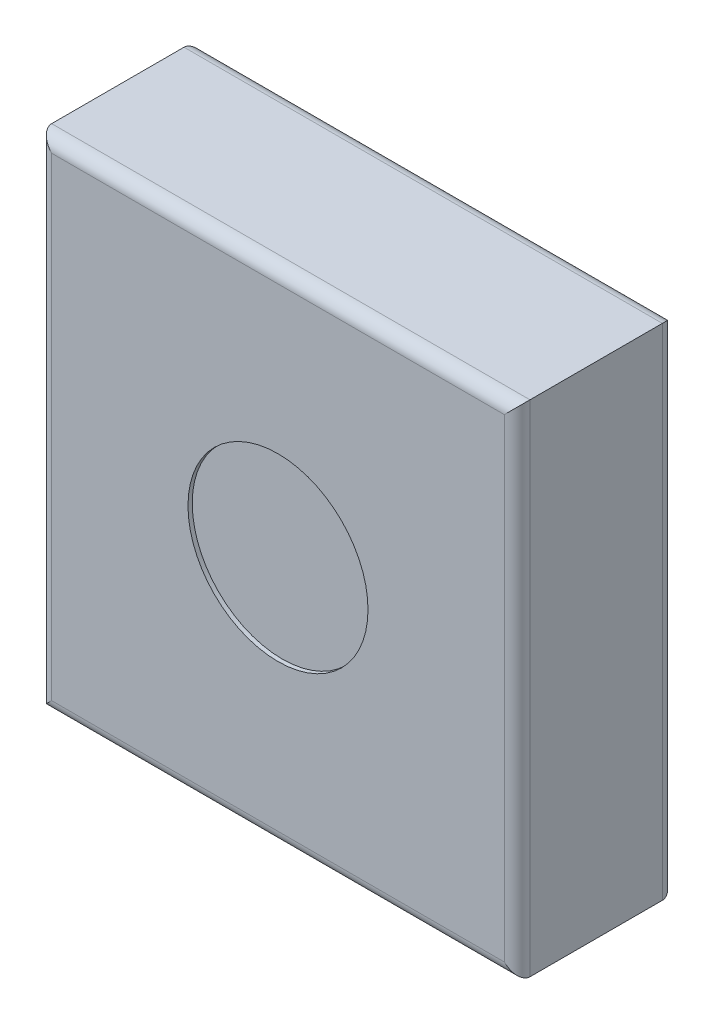
ISO-10303-21;
HEADER;
FILE_DESCRIPTION(('STEP AP214'),'2;1');
FILE_NAME('part.step','',(''),(''),'','','');
FILE_SCHEMA(('AUTOMOTIVE_DESIGN { 1 0 10303 214 1 1 1 1 }'));
ENDSEC;
DATA;
#1=APPLICATION_CONTEXT('core data for automotive mechanical design processes');
#2=APPLICATION_PROTOCOL_DEFINITION('international standard','automotive_design',2000,#1);
#3=PRODUCT_CONTEXT('',#1,'mechanical');
#4=PRODUCT('Part','Part','',(#3));
#5=PRODUCT_RELATED_PRODUCT_CATEGORY('part','',(#4));
#6=PRODUCT_DEFINITION_FORMATION('','',#4);
#7=PRODUCT_DEFINITION_CONTEXT('part definition',#1,'design');
#8=PRODUCT_DEFINITION('design','',#6,#7);
#9=PRODUCT_DEFINITION_SHAPE('','',#8);
#10=(LENGTH_UNIT() NAMED_UNIT(*) SI_UNIT(.MILLI.,.METRE.));
#11=(NAMED_UNIT(*) PLANE_ANGLE_UNIT() SI_UNIT($,.RADIAN.));
#12=(NAMED_UNIT(*) SI_UNIT($,.STERADIAN.) SOLID_ANGLE_UNIT());
#13=UNCERTAINTY_MEASURE_WITH_UNIT(LENGTH_MEASURE(1.E-05),#10,'distance_accuracy_value','');
#14=(GEOMETRIC_REPRESENTATION_CONTEXT(3) GLOBAL_UNCERTAINTY_ASSIGNED_CONTEXT((#13)) GLOBAL_UNIT_ASSIGNED_CONTEXT((#10,
#11,#12)) REPRESENTATION_CONTEXT('',''));
#15=CARTESIAN_POINT('',(0.,0.,0.));
#16=DIRECTION('',(0.,0.,1.));
#17=DIRECTION('',(1.,0.,0.));
#18=AXIS2_PLACEMENT_3D('',#15,#16,#17);
#19=CARTESIAN_POINT('',(56.,58.5,37.));
#20=DIRECTION('',(-1.,0.,0.));
#21=DIRECTION('',(0.,-1.,0.));
#22=AXIS2_PLACEMENT_3D('',#19,#20,#21);
#23=PLANE('',#22);
#24=DIRECTION('',(0.,0.,-1.));
#25=VECTOR('',#24,1.);
#26=CARTESIAN_POINT('',(56.,-58.5,37.));
#27=LINE('',#26,#25);
#28=CARTESIAN_POINT('',(56.,-58.5,34.));
#29=VERTEX_POINT('',#28);
#30=CARTESIAN_POINT('',(56.,-58.5,3.));
#31=VERTEX_POINT('',#30);
#32=EDGE_CURVE('E146',#29,#31,#27,.T.);
#33=ORIENTED_EDGE('',*,*,#32,.T.);
#34=DIRECTION('',(0.,1.,0.));
#35=VECTOR('',#34,1.);
#36=CARTESIAN_POINT('',(56.,58.5,3.));
#37=LINE('',#36,#35);
#38=CARTESIAN_POINT('',(56.,58.5,3.));
#39=VERTEX_POINT('',#38);
#40=EDGE_CURVE('E11',#31,#39,#37,.T.);
#41=ORIENTED_EDGE('',*,*,#40,.T.);
#42=DIRECTION('',(0.,0.,-1.));
#43=VECTOR('',#42,1.);
#44=CARTESIAN_POINT('',(56.,58.5,37.));
#45=LINE('',#44,#43);
#46=CARTESIAN_POINT('',(56.,58.5,34.));
#47=VERTEX_POINT('',#46);
#48=EDGE_CURVE('E123',#47,#39,#45,.T.);
#49=ORIENTED_EDGE('',*,*,#48,.F.);
#50=DIRECTION('',(0.,1.,0.));
#51=VECTOR('',#50,1.);
#52=CARTESIAN_POINT('',(56.,-58.5,34.));
#53=LINE('',#52,#51);
#54=EDGE_CURVE('E138',#47,#29,#53,.F.);
#55=ORIENTED_EDGE('',*,*,#54,.T.);
#56=EDGE_LOOP('',(#33,#41,#49,#55));
#57=FACE_BOUND('',#56,.T.);
#58=ADVANCED_FACE('F35',(#57),#23,.F.);
#59=CARTESIAN_POINT('',(-56.,58.5,37.));
#60=DIRECTION('',(0.,-1.,0.));
#61=DIRECTION('',(0.,0.,-1.));
#62=AXIS2_PLACEMENT_3D('',#59,#60,#61);
#63=PLANE('',#62);
#64=ORIENTED_EDGE('',*,*,#48,.T.);
#65=DIRECTION('',(-1.,0.,0.));
#66=VECTOR('',#65,1.);
#67=CARTESIAN_POINT('',(-56.,58.5,3.));
#68=LINE('',#67,#66);
#69=CARTESIAN_POINT('',(-56.,58.5,3.));
#70=VERTEX_POINT('',#69);
#71=EDGE_CURVE('E139',#39,#70,#68,.T.);
#72=ORIENTED_EDGE('',*,*,#71,.T.);
#73=DIRECTION('',(0.,0.,-1.));
#74=VECTOR('',#73,1.);
#75=CARTESIAN_POINT('',(-56.,58.5,37.));
#76=LINE('',#75,#74);
#77=CARTESIAN_POINT('',(-56.,58.5,34.));
#78=VERTEX_POINT('',#77);
#79=EDGE_CURVE('E190',#78,#70,#76,.T.);
#80=ORIENTED_EDGE('',*,*,#79,.F.);
#81=DIRECTION('',(-1.,0.,0.));
#82=VECTOR('',#81,1.);
#83=CARTESIAN_POINT('',(56.,58.5,34.));
#84=LINE('',#83,#82);
#85=EDGE_CURVE('E136',#78,#47,#84,.F.);
#86=ORIENTED_EDGE('',*,*,#85,.T.);
#87=EDGE_LOOP('',(#64,#72,#80,#86));
#88=FACE_BOUND('',#87,.T.);
#89=ADVANCED_FACE('F189',(#88),#63,.F.);
#90=CARTESIAN_POINT('',(-56.,58.5,37.));
#91=DIRECTION('',(1.,0.,0.));
#92=DIRECTION('',(0.,1.,0.));
#93=AXIS2_PLACEMENT_3D('',#90,#91,#92);
#94=PLANE('',#93);
#95=ORIENTED_EDGE('',*,*,#79,.T.);
#96=DIRECTION('',(0.,-1.,0.));
#97=VECTOR('',#96,1.);
#98=CARTESIAN_POINT('',(-56.,58.5,3.));
#99=LINE('',#98,#97);
#100=CARTESIAN_POINT('',(-56.,-58.5,3.));
#101=VERTEX_POINT('',#100);
#102=EDGE_CURVE('E59',#70,#101,#99,.T.);
#103=ORIENTED_EDGE('',*,*,#102,.T.);
#104=DIRECTION('',(0.,0.,-1.));
#105=VECTOR('',#104,1.);
#106=CARTESIAN_POINT('',(-56.,-58.5,37.));
#107=LINE('',#106,#105);
#108=CARTESIAN_POINT('',(-56.,-58.5,34.));
#109=VERTEX_POINT('',#108);
#110=EDGE_CURVE('E195',#109,#101,#107,.T.);
#111=ORIENTED_EDGE('',*,*,#110,.F.);
#112=DIRECTION('',(0.,-1.,0.));
#113=VECTOR('',#112,1.);
#114=CARTESIAN_POINT('',(-56.,58.5,34.));
#115=LINE('',#114,#113);
#116=EDGE_CURVE('E130',#109,#78,#115,.F.);
#117=ORIENTED_EDGE('',*,*,#116,.T.);
#118=EDGE_LOOP('',(#95,#103,#111,#117));
#119=FACE_BOUND('',#118,.T.);
#120=ADVANCED_FACE('F193',(#119),#94,.F.);
#121=CARTESIAN_POINT('',(-56.,-58.5,37.));
#122=DIRECTION('',(0.,1.,0.));
#123=DIRECTION('',(0.,0.,1.));
#124=AXIS2_PLACEMENT_3D('',#121,#122,#123);
#125=PLANE('',#124);
#126=ORIENTED_EDGE('',*,*,#110,.T.);
#127=DIRECTION('',(1.,0.,0.));
#128=VECTOR('',#127,1.);
#129=CARTESIAN_POINT('',(-56.,-58.5,3.));
#130=LINE('',#129,#128);
#131=EDGE_CURVE('E44',#101,#31,#130,.T.);
#132=ORIENTED_EDGE('',*,*,#131,.T.);
#133=ORIENTED_EDGE('',*,*,#32,.F.);
#134=DIRECTION('',(1.,0.,0.));
#135=VECTOR('',#134,1.);
#136=CARTESIAN_POINT('',(-56.,-58.5,34.));
#137=LINE('',#136,#135);
#138=EDGE_CURVE('E110',#29,#109,#137,.F.);
#139=ORIENTED_EDGE('',*,*,#138,.T.);
#140=EDGE_LOOP('',(#126,#132,#133,#139));
#141=FACE_BOUND('',#140,.T.);
#142=ADVANCED_FACE('F205',(#141),#125,.F.);
#143=CARTESIAN_POINT('',(0.,0.,37.));
#144=DIRECTION('',(0.,0.,1.));
#145=DIRECTION('',(1.,0.,0.));
#146=AXIS2_PLACEMENT_3D('',#143,#144,#145);
#147=PLANE('',#146);
#148=CARTESIAN_POINT('',(0.,0.,37.));
#149=DIRECTION('',(0.,0.,1.));
#150=DIRECTION('',(1.,0.,0.));
#151=AXIS2_PLACEMENT_3D('',#148,#149,#150);
#152=CIRCLE('',#151,21.0745832114447);
#153=CARTESIAN_POINT('',(21.0745832114447,0.,37.));
#154=VERTEX_POINT('',#153);
#155=EDGE_CURVE('E208',#154,#154,#152,.T.);
#156=ORIENTED_EDGE('',*,*,#155,.F.);
#157=EDGE_LOOP('',(#156));
#158=FACE_BOUND('',#157,.T.);
#159=DIRECTION('',(0.,-1.,0.));
#160=VECTOR('',#159,1.);
#161=CARTESIAN_POINT('',(-53.,-58.5,37.));
#162=LINE('',#161,#160);
#163=CARTESIAN_POINT('',(-53.,55.5,37.));
#164=VERTEX_POINT('',#163);
#165=CARTESIAN_POINT('',(-53.,-55.5,37.));
#166=VERTEX_POINT('',#165);
#167=EDGE_CURVE('E127',#164,#166,#162,.T.);
#168=ORIENTED_EDGE('',*,*,#167,.T.);
#169=DIRECTION('',(1.,0.,0.));
#170=VECTOR('',#169,1.);
#171=CARTESIAN_POINT('',(56.,-55.5,37.));
#172=LINE('',#171,#170);
#173=CARTESIAN_POINT('',(53.,-55.5,37.));
#174=VERTEX_POINT('',#173);
#175=EDGE_CURVE('E108',#166,#174,#172,.T.);
#176=ORIENTED_EDGE('',*,*,#175,.T.);
#177=DIRECTION('',(0.,1.,0.));
#178=VECTOR('',#177,1.);
#179=CARTESIAN_POINT('',(53.,58.5,37.));
#180=LINE('',#179,#178);
#181=CARTESIAN_POINT('',(53.,55.5,37.));
#182=VERTEX_POINT('',#181);
#183=EDGE_CURVE('E116',#174,#182,#180,.T.);
#184=ORIENTED_EDGE('',*,*,#183,.T.);
#185=DIRECTION('',(-1.,0.,0.));
#186=VECTOR('',#185,1.);
#187=CARTESIAN_POINT('',(-56.,55.5,37.));
#188=LINE('',#187,#186);
#189=EDGE_CURVE('E122',#182,#164,#188,.T.);
#190=ORIENTED_EDGE('',*,*,#189,.T.);
#191=EDGE_LOOP('',(#168,#176,#184,#190));
#192=FACE_BOUND('',#191,.T.);
#193=ADVANCED_FACE('F125',(#158,#192),#147,.T.);
#194=CARTESIAN_POINT('',(0.,0.,0.));
#195=DIRECTION('',(0.,0.,1.));
#196=DIRECTION('',(1.,0.,0.));
#197=AXIS2_PLACEMENT_3D('',#194,#195,#196);
#198=PLANE('',#197);
#199=DIRECTION('',(0.,-1.,0.));
#200=VECTOR('',#199,1.);
#201=CARTESIAN_POINT('',(-53.,0.,0.));
#202=LINE('',#201,#200);
#203=CARTESIAN_POINT('',(-53.,-55.5,0.));
#204=VERTEX_POINT('',#203);
#205=CARTESIAN_POINT('',(-53.,55.5,0.));
#206=VERTEX_POINT('',#205);
#207=EDGE_CURVE('E153',#204,#206,#202,.F.);
#208=ORIENTED_EDGE('',*,*,#207,.T.);
#209=DIRECTION('',(-1.,0.,0.));
#210=VECTOR('',#209,1.);
#211=CARTESIAN_POINT('',(0.,55.5,0.));
#212=LINE('',#211,#210);
#213=CARTESIAN_POINT('',(53.,55.5,0.));
#214=VERTEX_POINT('',#213);
#215=EDGE_CURVE('E155',#206,#214,#212,.F.);
#216=ORIENTED_EDGE('',*,*,#215,.T.);
#217=DIRECTION('',(0.,1.,0.));
#218=VECTOR('',#217,1.);
#219=CARTESIAN_POINT('',(53.,0.,0.));
#220=LINE('',#219,#218);
#221=CARTESIAN_POINT('',(53.,-55.5,0.));
#222=VERTEX_POINT('',#221);
#223=EDGE_CURVE('E149',#214,#222,#220,.F.);
#224=ORIENTED_EDGE('',*,*,#223,.T.);
#225=DIRECTION('',(1.,0.,0.));
#226=VECTOR('',#225,1.);
#227=CARTESIAN_POINT('',(0.,-55.5,0.));
#228=LINE('',#227,#226);
#229=EDGE_CURVE('E151',#222,#204,#228,.F.);
#230=ORIENTED_EDGE('',*,*,#229,.T.);
#231=EDGE_LOOP('',(#208,#216,#224,#230));
#232=FACE_BOUND('',#231,.T.);
#233=ADVANCED_FACE('F179',(#232),#198,.F.);
#234=CARTESIAN_POINT('',(0.,55.5,34.));
#235=DIRECTION('',(1.,0.,0.));
#236=DIRECTION('',(0.,0.,-1.));
#237=AXIS2_PLACEMENT_3D('',#234,#235,#236);
#238=CYLINDRICAL_SURFACE('',#237,3.);
#239=CARTESIAN_POINT('',(53.,55.5,34.));
#240=DIRECTION('',(0.707106781186548,-0.707106781186547,0.));
#241=DIRECTION('',(-0.707106781186547,-0.707106781186548,0.));
#242=AXIS2_PLACEMENT_3D('',#239,#240,#241);
#243=ELLIPSE('',#242,4.24264068711928,3.);
#244=EDGE_CURVE('E119',#47,#182,#243,.T.);
#245=ORIENTED_EDGE('',*,*,#244,.F.);
#246=ORIENTED_EDGE('',*,*,#85,.F.);
#247=CARTESIAN_POINT('',(-53.,55.5,34.));
#248=DIRECTION('',(0.707106781186547,0.707106781186548,0.));
#249=DIRECTION('',(0.707106781186547,-0.707106781186547,0.));
#250=AXIS2_PLACEMENT_3D('',#247,#248,#249);
#251=ELLIPSE('',#250,4.24264068711929,3.);
#252=EDGE_CURVE('E143',#164,#78,#251,.F.);
#253=ORIENTED_EDGE('',*,*,#252,.F.);
#254=ORIENTED_EDGE('',*,*,#189,.F.);
#255=EDGE_LOOP('',(#245,#246,#253,#254));
#256=FACE_BOUND('',#255,.T.);
#257=ADVANCED_FACE('F202',(#256),#238,.T.);
#258=CARTESIAN_POINT('',(-53.,0.,34.));
#259=DIRECTION('',(0.,1.,0.));
#260=DIRECTION('',(-1.,0.,0.));
#261=AXIS2_PLACEMENT_3D('',#258,#259,#260);
#262=CYLINDRICAL_SURFACE('',#261,3.);
#263=ORIENTED_EDGE('',*,*,#252,.T.);
#264=ORIENTED_EDGE('',*,*,#116,.F.);
#265=CARTESIAN_POINT('',(-53.,-55.5,34.));
#266=DIRECTION('',(-0.707106781186547,0.707106781186547,0.));
#267=DIRECTION('',(0.707106781186547,0.707106781186548,0.));
#268=AXIS2_PLACEMENT_3D('',#265,#266,#267);
#269=ELLIPSE('',#268,4.24264068711928,3.);
#270=EDGE_CURVE('E113',#166,#109,#269,.F.);
#271=ORIENTED_EDGE('',*,*,#270,.F.);
#272=ORIENTED_EDGE('',*,*,#167,.F.);
#273=EDGE_LOOP('',(#263,#264,#271,#272));
#274=FACE_BOUND('',#273,.T.);
#275=ADVANCED_FACE('F204',(#274),#262,.T.);
#276=CARTESIAN_POINT('',(53.,0.,34.));
#277=DIRECTION('',(0.,-1.,0.));
#278=DIRECTION('',(1.,0.,0.));
#279=AXIS2_PLACEMENT_3D('',#276,#277,#278);
#280=CYLINDRICAL_SURFACE('',#279,3.);
#281=ORIENTED_EDGE('',*,*,#244,.T.);
#282=ORIENTED_EDGE('',*,*,#183,.F.);
#283=CARTESIAN_POINT('',(53.,-55.5,34.));
#284=DIRECTION('',(-0.707106781186547,-0.707106781186548,0.));
#285=DIRECTION('',(0.707106781186548,-0.707106781186547,0.));
#286=AXIS2_PLACEMENT_3D('',#283,#284,#285);
#287=ELLIPSE('',#286,4.24264068711929,3.);
#288=EDGE_CURVE('E104',#29,#174,#287,.T.);
#289=ORIENTED_EDGE('',*,*,#288,.F.);
#290=ORIENTED_EDGE('',*,*,#54,.F.);
#291=EDGE_LOOP('',(#281,#282,#289,#290));
#292=FACE_BOUND('',#291,.T.);
#293=ADVANCED_FACE('F117',(#292),#280,.T.);
#294=CARTESIAN_POINT('',(0.,-55.5,34.));
#295=DIRECTION('',(-1.,0.,0.));
#296=DIRECTION('',(0.,0.,1.));
#297=AXIS2_PLACEMENT_3D('',#294,#295,#296);
#298=CYLINDRICAL_SURFACE('',#297,3.);
#299=ORIENTED_EDGE('',*,*,#270,.T.);
#300=ORIENTED_EDGE('',*,*,#138,.F.);
#301=ORIENTED_EDGE('',*,*,#288,.T.);
#302=ORIENTED_EDGE('',*,*,#175,.F.);
#303=EDGE_LOOP('',(#299,#300,#301,#302));
#304=FACE_BOUND('',#303,.T.);
#305=ADVANCED_FACE('F106',(#304),#298,.T.);
#306=CARTESIAN_POINT('',(-56.,-55.5,3.));
#307=DIRECTION('',(1.,0.,0.));
#308=DIRECTION('',(0.,0.,-1.));
#309=AXIS2_PLACEMENT_3D('',#306,#307,#308);
#310=CYLINDRICAL_SURFACE('',#309,3.);
#311=CARTESIAN_POINT('',(-53.,-55.5,3.));
#312=DIRECTION('',(0.707106781186547,-0.707106781186547,0.));
#313=DIRECTION('',(0.707106781186547,0.707106781186548,0.));
#314=AXIS2_PLACEMENT_3D('',#311,#312,#313);
#315=ELLIPSE('',#314,4.24264068711928,3.);
#316=EDGE_CURVE('E164',#204,#101,#315,.F.);
#317=ORIENTED_EDGE('',*,*,#316,.F.);
#318=ORIENTED_EDGE('',*,*,#229,.F.);
#319=CARTESIAN_POINT('',(53.,-55.5,3.));
#320=DIRECTION('',(0.707106781186547,0.707106781186548,0.));
#321=DIRECTION('',(-0.707106781186548,0.707106781186547,0.));
#322=AXIS2_PLACEMENT_3D('',#319,#320,#321);
#323=ELLIPSE('',#322,4.24264068711929,3.);
#324=EDGE_CURVE('E39',#31,#222,#323,.T.);
#325=ORIENTED_EDGE('',*,*,#324,.F.);
#326=ORIENTED_EDGE('',*,*,#131,.F.);
#327=EDGE_LOOP('',(#317,#318,#325,#326));
#328=FACE_BOUND('',#327,.T.);
#329=ADVANCED_FACE('F37',(#328),#310,.T.);
#330=CARTESIAN_POINT('',(53.,58.5,3.));
#331=DIRECTION('',(0.,1.,0.));
#332=DIRECTION('',(-1.,0.,0.));
#333=AXIS2_PLACEMENT_3D('',#330,#331,#332);
#334=CYLINDRICAL_SURFACE('',#333,3.);
#335=ORIENTED_EDGE('',*,*,#324,.T.);
#336=ORIENTED_EDGE('',*,*,#223,.F.);
#337=CARTESIAN_POINT('',(53.,55.5,3.));
#338=DIRECTION('',(-0.707106781186548,0.707106781186547,0.));
#339=DIRECTION('',(0.707106781186547,0.707106781186548,0.));
#340=AXIS2_PLACEMENT_3D('',#337,#338,#339);
#341=ELLIPSE('',#340,4.24264068711928,3.);
#342=EDGE_CURVE('E162',#39,#214,#341,.T.);
#343=ORIENTED_EDGE('',*,*,#342,.F.);
#344=ORIENTED_EDGE('',*,*,#40,.F.);
#345=EDGE_LOOP('',(#335,#336,#343,#344));
#346=FACE_BOUND('',#345,.T.);
#347=ADVANCED_FACE('F174',(#346),#334,.T.);
#348=CARTESIAN_POINT('',(-53.,58.5,3.));
#349=DIRECTION('',(0.,-1.,0.));
#350=DIRECTION('',(1.,0.,0.));
#351=AXIS2_PLACEMENT_3D('',#348,#349,#350);
#352=CYLINDRICAL_SURFACE('',#351,3.);
#353=ORIENTED_EDGE('',*,*,#316,.T.);
#354=ORIENTED_EDGE('',*,*,#102,.F.);
#355=CARTESIAN_POINT('',(-53.,55.5,3.));
#356=DIRECTION('',(-0.707106781186547,-0.707106781186548,0.));
#357=DIRECTION('',(0.707106781186547,-0.707106781186547,0.));
#358=AXIS2_PLACEMENT_3D('',#355,#356,#357);
#359=ELLIPSE('',#358,4.24264068711929,3.);
#360=EDGE_CURVE('E160',#206,#70,#359,.F.);
#361=ORIENTED_EDGE('',*,*,#360,.F.);
#362=ORIENTED_EDGE('',*,*,#207,.F.);
#363=EDGE_LOOP('',(#353,#354,#361,#362));
#364=FACE_BOUND('',#363,.T.);
#365=ADVANCED_FACE('F185',(#364),#352,.T.);
#366=CARTESIAN_POINT('',(-56.,55.5,3.));
#367=DIRECTION('',(-1.,0.,0.));
#368=DIRECTION('',(0.,0.,1.));
#369=AXIS2_PLACEMENT_3D('',#366,#367,#368);
#370=CYLINDRICAL_SURFACE('',#369,3.);
#371=ORIENTED_EDGE('',*,*,#342,.T.);
#372=ORIENTED_EDGE('',*,*,#215,.F.);
#373=ORIENTED_EDGE('',*,*,#360,.T.);
#374=ORIENTED_EDGE('',*,*,#71,.F.);
#375=EDGE_LOOP('',(#371,#372,#373,#374));
#376=FACE_BOUND('',#375,.T.);
#377=ADVANCED_FACE('F183',(#376),#370,.T.);
#378=CARTESIAN_POINT('',(0.,0.,36.));
#379=DIRECTION('',(0.,0.,1.));
#380=DIRECTION('',(1.,0.,0.));
#381=AXIS2_PLACEMENT_3D('',#378,#379,#380);
#382=CYLINDRICAL_SURFACE('',#381,21.0745832114447);
#383=CARTESIAN_POINT('',(0.,0.,36.));
#384=DIRECTION('',(0.,0.,1.));
#385=DIRECTION('',(1.,0.,0.));
#386=AXIS2_PLACEMENT_3D('',#383,#384,#385);
#387=CIRCLE('',#386,21.0745832114447);
#388=CARTESIAN_POINT('',(21.0745832114447,0.,36.));
#389=VERTEX_POINT('',#388);
#390=EDGE_CURVE('E163',#389,#389,#387,.T.);
#391=ORIENTED_EDGE('',*,*,#390,.F.);
#392=EDGE_LOOP('',(#391));
#393=FACE_BOUND('',#392,.T.);
#394=ORIENTED_EDGE('',*,*,#155,.T.);
#395=EDGE_LOOP('',(#394));
#396=FACE_BOUND('',#395,.T.);
#397=ADVANCED_FACE('F216',(#393,#396),#382,.F.);
#398=CARTESIAN_POINT('',(0.,0.,36.));
#399=DIRECTION('',(0.,0.,1.));
#400=DIRECTION('',(1.,0.,0.));
#401=AXIS2_PLACEMENT_3D('',#398,#399,#400);
#402=PLANE('',#401);
#403=ORIENTED_EDGE('',*,*,#390,.T.);
#404=EDGE_LOOP('',(#403));
#405=FACE_BOUND('',#404,.T.);
#406=ADVANCED_FACE('F214',(#405),#402,.T.);
#407=CLOSED_SHELL('',(#58,#89,#120,#142,#193,#233,#257,#275,#293,#305,#329,#347,#365,#377,#397,#406));
#408=MANIFOLD_SOLID_BREP('B2',#407);
#409=ADVANCED_BREP_SHAPE_REPRESENTATION('',(#18,#408),#14);
#410=SHAPE_DEFINITION_REPRESENTATION(#9,#409);
ENDSEC;
END-ISO-10303-21;
